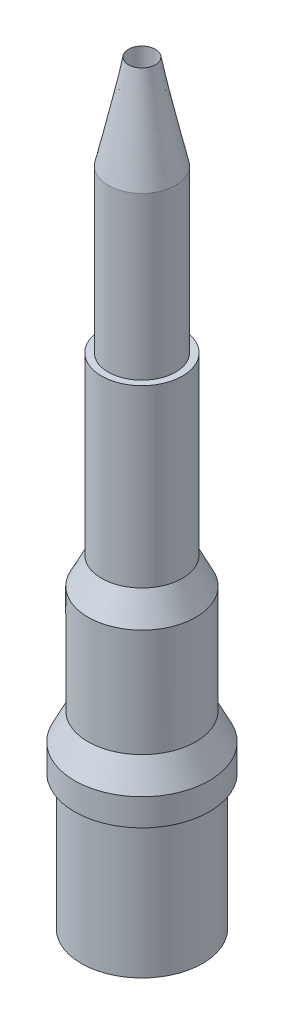
ISO-10303-21;
HEADER;
FILE_DESCRIPTION(('STEP AP214'),'2;1');
FILE_NAME('part.step','',(''),(''),'','','');
FILE_SCHEMA(('AUTOMOTIVE_DESIGN { 1 0 10303 214 1 1 1 1 }'));
ENDSEC;
DATA;
#1=APPLICATION_CONTEXT('core data for automotive mechanical design processes');
#2=APPLICATION_PROTOCOL_DEFINITION('international standard','automotive_design',2000,#1);
#3=PRODUCT_CONTEXT('',#1,'mechanical');
#4=PRODUCT('Part','Part','',(#3));
#5=PRODUCT_RELATED_PRODUCT_CATEGORY('part','',(#4));
#6=PRODUCT_DEFINITION_FORMATION('','',#4);
#7=PRODUCT_DEFINITION_CONTEXT('part definition',#1,'design');
#8=PRODUCT_DEFINITION('design','',#6,#7);
#9=PRODUCT_DEFINITION_SHAPE('','',#8);
#10=(LENGTH_UNIT() NAMED_UNIT(*) SI_UNIT(.MILLI.,.METRE.));
#11=(NAMED_UNIT(*) PLANE_ANGLE_UNIT() SI_UNIT($,.RADIAN.));
#12=(NAMED_UNIT(*) SI_UNIT($,.STERADIAN.) SOLID_ANGLE_UNIT());
#13=UNCERTAINTY_MEASURE_WITH_UNIT(LENGTH_MEASURE(1.E-05),#10,'distance_accuracy_value','');
#14=(GEOMETRIC_REPRESENTATION_CONTEXT(3) GLOBAL_UNCERTAINTY_ASSIGNED_CONTEXT((#13)) GLOBAL_UNIT_ASSIGNED_CONTEXT((#10,
#11,#12)) REPRESENTATION_CONTEXT('',''));
#15=CARTESIAN_POINT('',(0.,0.,0.));
#16=DIRECTION('',(0.,0.,1.));
#17=DIRECTION('',(1.,0.,0.));
#18=AXIS2_PLACEMENT_3D('',#15,#16,#17);
#19=CARTESIAN_POINT('',(0.,5.,0.));
#20=DIRECTION('',(0.,-1.,0.));
#21=DIRECTION('',(0.,0.,-1.));
#22=AXIS2_PLACEMENT_3D('',#19,#20,#21);
#23=CYLINDRICAL_SURFACE('',#22,2.25);
#24=CARTESIAN_POINT('',(0.,5.,0.));
#25=DIRECTION('',(0.,1.,0.));
#26=DIRECTION('',(0.,0.,1.));
#27=AXIS2_PLACEMENT_3D('',#24,#25,#26);
#28=CIRCLE('',#27,2.25);
#29=CARTESIAN_POINT('',(0.,5.,2.25));
#30=VERTEX_POINT('',#29);
#31=EDGE_CURVE('E50',#30,#30,#28,.T.);
#32=ORIENTED_EDGE('',*,*,#31,.F.);
#33=EDGE_LOOP('',(#32));
#34=FACE_BOUND('',#33,.T.);
#35=CARTESIAN_POINT('',(0.,0.,0.));
#36=DIRECTION('',(0.,1.,0.));
#37=DIRECTION('',(0.,0.,1.));
#38=AXIS2_PLACEMENT_3D('',#35,#36,#37);
#39=CIRCLE('',#38,2.25);
#40=CARTESIAN_POINT('',(0.,0.,2.25));
#41=VERTEX_POINT('',#40);
#42=EDGE_CURVE('E100',#41,#41,#39,.T.);
#43=ORIENTED_EDGE('',*,*,#42,.T.);
#44=EDGE_LOOP('',(#43));
#45=FACE_BOUND('',#44,.T.);
#46=ADVANCED_FACE('F36',(#34,#45),#23,.T.);
#47=CARTESIAN_POINT('',(0.,0.,0.));
#48=DIRECTION('',(0.,1.,0.));
#49=DIRECTION('',(0.,0.,1.));
#50=AXIS2_PLACEMENT_3D('',#47,#48,#49);
#51=PLANE('',#50);
#52=CARTESIAN_POINT('',(0.,0.,0.));
#53=DIRECTION('',(0.,1.,0.));
#54=DIRECTION('',(0.,0.,1.));
#55=AXIS2_PLACEMENT_3D('',#52,#53,#54);
#56=CIRCLE('',#55,0.5);
#57=CARTESIAN_POINT('',(0.,0.,0.5));
#58=VERTEX_POINT('',#57);
#59=EDGE_CURVE('E150',#58,#58,#56,.T.);
#60=ORIENTED_EDGE('',*,*,#59,.T.);
#61=EDGE_LOOP('',(#60));
#62=FACE_BOUND('',#61,.T.);
#63=ORIENTED_EDGE('',*,*,#42,.F.);
#64=EDGE_LOOP('',(#63));
#65=FACE_BOUND('',#64,.T.);
#66=ADVANCED_FACE('F106',(#62,#65),#51,.F.);
#67=CARTESIAN_POINT('',(0.,7.,0.));
#68=DIRECTION('',(0.,-1.,0.));
#69=DIRECTION('',(0.,0.,-1.));
#70=AXIS2_PLACEMENT_3D('',#67,#68,#69);
#71=CYLINDRICAL_SURFACE('',#70,2.5);
#72=CARTESIAN_POINT('',(0.,5.99999999999999,0.));
#73=DIRECTION('',(0.,1.,0.));
#74=DIRECTION('',(0.,0.,1.));
#75=AXIS2_PLACEMENT_3D('',#72,#73,#74);
#76=CIRCLE('',#75,2.5);
#77=CARTESIAN_POINT('',(0.,5.99999999999999,2.5));
#78=VERTEX_POINT('',#77);
#79=EDGE_CURVE('E11',#78,#78,#76,.F.);
#80=ORIENTED_EDGE('',*,*,#79,.T.);
#81=EDGE_LOOP('',(#80));
#82=FACE_BOUND('',#81,.T.);
#83=CARTESIAN_POINT('',(0.,5.,0.));
#84=DIRECTION('',(0.,1.,0.));
#85=DIRECTION('',(0.,0.,1.));
#86=AXIS2_PLACEMENT_3D('',#83,#84,#85);
#87=CIRCLE('',#86,2.5);
#88=CARTESIAN_POINT('',(0.,5.,2.5));
#89=VERTEX_POINT('',#88);
#90=EDGE_CURVE('E57',#89,#89,#87,.T.);
#91=ORIENTED_EDGE('',*,*,#90,.T.);
#92=EDGE_LOOP('',(#91));
#93=FACE_BOUND('',#92,.T.);
#94=ADVANCED_FACE('F108',(#82,#93),#71,.T.);
#95=CARTESIAN_POINT('',(0.,5.,0.));
#96=DIRECTION('',(0.,1.,0.));
#97=DIRECTION('',(0.,0.,1.));
#98=AXIS2_PLACEMENT_3D('',#95,#96,#97);
#99=PLANE('',#98);
#100=ORIENTED_EDGE('',*,*,#31,.T.);
#101=EDGE_LOOP('',(#100));
#102=FACE_BOUND('',#101,.T.);
#103=ORIENTED_EDGE('',*,*,#90,.F.);
#104=EDGE_LOOP('',(#103));
#105=FACE_BOUND('',#104,.T.);
#106=ADVANCED_FACE('F115',(#102,#105),#99,.F.);
#107=CARTESIAN_POINT('',(0.,7.,0.));
#108=DIRECTION('',(0.,-1.,0.));
#109=DIRECTION('',(0.,0.,-1.));
#110=AXIS2_PLACEMENT_3D('',#107,#108,#109);
#111=CONICAL_SURFACE('',#110,2.,0.463647609000804);
#112=ORIENTED_EDGE('',*,*,#79,.F.);
#113=EDGE_LOOP('',(#112));
#114=FACE_BOUND('',#113,.T.);
#115=CARTESIAN_POINT('',(0.,7.,0.));
#116=DIRECTION('',(0.,1.,0.));
#117=DIRECTION('',(0.,0.,1.));
#118=AXIS2_PLACEMENT_3D('',#115,#116,#117);
#119=CIRCLE('',#118,2.);
#120=CARTESIAN_POINT('',(0.,7.,2.));
#121=VERTEX_POINT('',#120);
#122=EDGE_CURVE('E45',#121,#121,#119,.T.);
#123=ORIENTED_EDGE('',*,*,#122,.F.);
#124=EDGE_LOOP('',(#123));
#125=FACE_BOUND('',#124,.T.);
#126=ADVANCED_FACE('F38',(#114,#125),#111,.T.);
#127=CARTESIAN_POINT('',(0.,11.,0.));
#128=DIRECTION('',(0.,-1.,0.));
#129=DIRECTION('',(0.,0.,-1.));
#130=AXIS2_PLACEMENT_3D('',#127,#128,#129);
#131=CYLINDRICAL_SURFACE('',#130,2.);
#132=CARTESIAN_POINT('',(0.,11.,0.));
#133=DIRECTION('',(0.,-1.,0.));
#134=DIRECTION('',(0.,0.,-1.));
#135=AXIS2_PLACEMENT_3D('',#132,#133,#134);
#136=CIRCLE('',#135,2.);
#137=CARTESIAN_POINT('',(0.,11.,-2.));
#138=VERTEX_POINT('',#137);
#139=EDGE_CURVE('E54',#138,#138,#136,.F.);
#140=ORIENTED_EDGE('',*,*,#139,.F.);
#141=EDGE_LOOP('',(#140));
#142=FACE_BOUND('',#141,.T.);
#143=ORIENTED_EDGE('',*,*,#122,.T.);
#144=EDGE_LOOP('',(#143));
#145=FACE_BOUND('',#144,.T.);
#146=ADVANCED_FACE('F83',(#142,#145),#131,.T.);
#147=CARTESIAN_POINT('',(0.,12.,0.));
#148=DIRECTION('',(0.,-1.,0.));
#149=DIRECTION('',(0.,0.,-1.));
#150=AXIS2_PLACEMENT_3D('',#147,#148,#149);
#151=CONICAL_SURFACE('',#150,1.5,0.463647609000806);
#152=ORIENTED_EDGE('',*,*,#139,.T.);
#153=EDGE_LOOP('',(#152));
#154=FACE_BOUND('',#153,.T.);
#155=CARTESIAN_POINT('',(0.,12.,0.));
#156=DIRECTION('',(0.,1.,0.));
#157=DIRECTION('',(0.,0.,1.));
#158=AXIS2_PLACEMENT_3D('',#155,#156,#157);
#159=CIRCLE('',#158,1.5);
#160=CARTESIAN_POINT('',(0.,12.,-1.5));
#161=VERTEX_POINT('',#160);
#162=EDGE_CURVE('E40',#161,#161,#159,.T.);
#163=ORIENTED_EDGE('',*,*,#162,.F.);
#164=EDGE_LOOP('',(#163));
#165=FACE_BOUND('',#164,.T.);
#166=ADVANCED_FACE('F77',(#154,#165),#151,.T.);
#167=CARTESIAN_POINT('',(0.,18.5,0.));
#168=DIRECTION('',(0.,-1.,0.));
#169=DIRECTION('',(0.,0.,-1.));
#170=AXIS2_PLACEMENT_3D('',#167,#168,#169);
#171=CYLINDRICAL_SURFACE('',#170,1.5);
#172=CARTESIAN_POINT('',(0.,18.5,0.));
#173=DIRECTION('',(0.,1.,0.));
#174=DIRECTION('',(0.,0.,1.));
#175=AXIS2_PLACEMENT_3D('',#172,#173,#174);
#176=CIRCLE('',#175,1.5);
#177=CARTESIAN_POINT('',(0.,18.5,-1.5));
#178=VERTEX_POINT('',#177);
#179=EDGE_CURVE('E140',#178,#178,#176,.T.);
#180=CARTESIAN_POINT('',(0.,18.5,-1.5));
#181=CARTESIAN_POINT('',(0.,18.4322916666667,-1.5));
#182=CARTESIAN_POINT('',(0.,18.3645833333333,-1.5));
#183=CARTESIAN_POINT('',(0.,18.2291666666667,-1.5));
#184=CARTESIAN_POINT('',(0.,18.1614583333333,-1.5));
#185=CARTESIAN_POINT('',(0.,18.0260416666667,-1.5));
#186=CARTESIAN_POINT('',(0.,17.9583333333333,-1.5));
#187=CARTESIAN_POINT('',(0.,17.8229166666667,-1.5));
#188=CARTESIAN_POINT('',(0.,17.7552083333333,-1.5));
#189=CARTESIAN_POINT('',(0.,17.6197916666667,-1.5));
#190=CARTESIAN_POINT('',(0.,17.5520833333333,-1.5));
#191=CARTESIAN_POINT('',(0.,17.4166666666667,-1.5));
#192=CARTESIAN_POINT('',(0.,17.3489583333333,-1.5));
#193=CARTESIAN_POINT('',(0.,17.2135416666667,-1.5));
#194=CARTESIAN_POINT('',(0.,17.1458333333333,-1.5));
#195=CARTESIAN_POINT('',(0.,17.0104166666667,-1.5));
#196=CARTESIAN_POINT('',(0.,16.9427083333333,-1.5));
#197=CARTESIAN_POINT('',(0.,16.8072916666667,-1.5));
#198=CARTESIAN_POINT('',(0.,16.7395833333333,-1.5));
#199=CARTESIAN_POINT('',(0.,16.6041666666667,-1.5));
#200=CARTESIAN_POINT('',(0.,16.5364583333333,-1.5));
#201=CARTESIAN_POINT('',(0.,16.4010416666667,-1.5));
#202=CARTESIAN_POINT('',(0.,16.3333333333333,-1.5));
#203=CARTESIAN_POINT('',(0.,16.1979166666667,-1.5));
#204=CARTESIAN_POINT('',(0.,16.1302083333333,-1.5));
#205=CARTESIAN_POINT('',(0.,15.9947916666667,-1.5));
#206=CARTESIAN_POINT('',(0.,15.9270833333333,-1.5));
#207=CARTESIAN_POINT('',(0.,15.7916666666667,-1.5));
#208=CARTESIAN_POINT('',(0.,15.7239583333333,-1.5));
#209=CARTESIAN_POINT('',(0.,15.5885416666667,-1.5));
#210=CARTESIAN_POINT('',(0.,15.5208333333333,-1.5));
#211=CARTESIAN_POINT('',(0.,15.3854166666667,-1.5));
#212=CARTESIAN_POINT('',(0.,15.3177083333333,-1.5));
#213=CARTESIAN_POINT('',(0.,15.1822916666667,-1.5));
#214=CARTESIAN_POINT('',(0.,15.1145833333333,-1.5));
#215=CARTESIAN_POINT('',(0.,14.9791666666667,-1.5));
#216=CARTESIAN_POINT('',(0.,14.9114583333333,-1.5));
#217=CARTESIAN_POINT('',(0.,14.7760416666667,-1.5));
#218=CARTESIAN_POINT('',(0.,14.7083333333333,-1.5));
#219=CARTESIAN_POINT('',(0.,14.5729166666667,-1.5));
#220=CARTESIAN_POINT('',(0.,14.5052083333333,-1.5));
#221=CARTESIAN_POINT('',(0.,14.3697916666667,-1.5));
#222=CARTESIAN_POINT('',(0.,14.3020833333333,-1.5));
#223=CARTESIAN_POINT('',(0.,14.1666666666667,-1.5));
#224=CARTESIAN_POINT('',(0.,14.0989583333333,-1.5));
#225=CARTESIAN_POINT('',(0.,13.9635416666667,-1.5));
#226=CARTESIAN_POINT('',(0.,13.8958333333333,-1.5));
#227=CARTESIAN_POINT('',(0.,13.7604166666667,-1.5));
#228=CARTESIAN_POINT('',(0.,13.6927083333333,-1.5));
#229=CARTESIAN_POINT('',(0.,13.5572916666667,-1.5));
#230=CARTESIAN_POINT('',(0.,13.4895833333333,-1.5));
#231=CARTESIAN_POINT('',(0.,13.3541666666667,-1.5));
#232=CARTESIAN_POINT('',(0.,13.2864583333333,-1.5));
#233=CARTESIAN_POINT('',(0.,13.1510416666667,-1.5));
#234=CARTESIAN_POINT('',(0.,13.0833333333333,-1.5));
#235=CARTESIAN_POINT('',(0.,12.9479166666667,-1.5));
#236=CARTESIAN_POINT('',(0.,12.8802083333333,-1.5));
#237=CARTESIAN_POINT('',(0.,12.7447916666667,-1.5));
#238=CARTESIAN_POINT('',(0.,12.6770833333333,-1.5));
#239=CARTESIAN_POINT('',(0.,12.5416666666667,-1.5));
#240=CARTESIAN_POINT('',(0.,12.4739583333333,-1.5));
#241=CARTESIAN_POINT('',(0.,12.3385416666667,-1.5));
#242=CARTESIAN_POINT('',(0.,12.2708333333333,-1.5));
#243=CARTESIAN_POINT('',(0.,12.1354166666667,-1.5));
#244=CARTESIAN_POINT('',(0.,12.0677083333333,-1.5));
#245=CARTESIAN_POINT('',(0.,12.,-1.5));
#246=B_SPLINE_CURVE_WITH_KNOTS('',3,(#180,#181,#182,#183,#184,#185,#186,#187,#188,#189,#190,
#191,#192,#193,#194,#195,#196,#197,#198,#199,#200,#201,#202,#203,#204,#205,#206,#207,#208,#209,
#210,#211,#212,#213,#214,#215,#216,#217,#218,#219,#220,#221,#222,#223,#224,#225,#226,#227,#228,
#229,#230,#231,#232,#233,#234,#235,#236,#237,#238,#239,#240,#241,#242,#243,#244,#245),
.UNSPECIFIED.,.F.,.F.,(4,2,2,2,2,2,2,2,2,2,2,2,2,2,2,2,2,2,2,2,2,2,2,2,2,2,2,2,2,2,2,2,4),(0.,
0.203125000000002,0.40625,0.609375000000002,0.812500000000001,1.015625,1.21875,1.421875,1.625,
1.828125,2.03125,2.234375,2.4375,2.640625,2.84375,3.046875,3.25,3.453125,3.65625,3.859375,
4.0625,4.265625,4.46875,4.671875,4.875,5.078125,5.28125,5.484375,5.6875,5.890625,6.09375,
6.296875,6.5),.UNSPECIFIED.);
#247=EDGE_CURVE('BSEAM66',#178,#161,#246,.T.);
#248=ORIENTED_EDGE('',*,*,#179,.F.);
#249=ORIENTED_EDGE('',*,*,#162,.T.);
#250=ORIENTED_EDGE('',*,*,#247,.T.);
#251=ORIENTED_EDGE('',*,*,#247,.F.);
#252=EDGE_LOOP('',(#248,#250,#249,#251));
#253=FACE_BOUND('',#252,.T.);
#254=ADVANCED_FACE('F66',(#253),#171,.T.);
#255=CARTESIAN_POINT('',(0.,18.5,0.));
#256=DIRECTION('',(0.,1.,0.));
#257=DIRECTION('',(0.,0.,1.));
#258=AXIS2_PLACEMENT_3D('',#255,#256,#257);
#259=PLANE('',#258);
#260=CARTESIAN_POINT('',(0.,18.5,0.));
#261=DIRECTION('',(0.,1.,0.));
#262=DIRECTION('',(0.,0.,1.));
#263=AXIS2_PLACEMENT_3D('',#260,#261,#262);
#264=CIRCLE('',#263,1.25);
#265=CARTESIAN_POINT('',(0.,18.5,1.25));
#266=VERTEX_POINT('',#265);
#267=EDGE_CURVE('E146',#266,#266,#264,.T.);
#268=ORIENTED_EDGE('',*,*,#267,.F.);
#269=EDGE_LOOP('',(#268));
#270=FACE_BOUND('',#269,.T.);
#271=ORIENTED_EDGE('',*,*,#179,.T.);
#272=EDGE_LOOP('',(#271));
#273=FACE_BOUND('',#272,.T.);
#274=ADVANCED_FACE('F76',(#270,#273),#259,.T.);
#275=CARTESIAN_POINT('',(0.,24.5,0.));
#276=DIRECTION('',(0.,-1.,0.));
#277=DIRECTION('',(0.,0.,-1.));
#278=AXIS2_PLACEMENT_3D('',#275,#276,#277);
#279=CYLINDRICAL_SURFACE('',#278,1.25);
#280=CARTESIAN_POINT('',(0.,24.5,0.));
#281=DIRECTION('',(0.,1.,0.));
#282=DIRECTION('',(0.,0.,1.));
#283=AXIS2_PLACEMENT_3D('',#280,#281,#282);
#284=CIRCLE('',#283,1.25);
#285=CARTESIAN_POINT('',(0.351754629549075,24.5,-1.19948684052423));
#286=VERTEX_POINT('',#285);
#287=EDGE_CURVE('E142',#286,#286,#284,.T.);
#288=ORIENTED_EDGE('',*,*,#287,.F.);
#289=EDGE_LOOP('',(#288));
#290=FACE_BOUND('',#289,.T.);
#291=ORIENTED_EDGE('',*,*,#267,.T.);
#292=EDGE_LOOP('',(#291));
#293=FACE_BOUND('',#292,.T.);
#294=ADVANCED_FACE('F165',(#290,#293),#279,.T.);
#295=CARTESIAN_POINT('',(0.351754629549075,24.5,-1.19948684052423));
#296=CARTESIAN_POINT('',(0.334643117785164,28.,-0.371502333396474));
#297=CARTESIAN_POINT('',(-2.04721905149938,24.5,-1.90299609962238));
#298=CARTESIAN_POINT('',(-0.408361549007783,28.,-1.0407885689668));
#299=CARTESIAN_POINT('',(-2.75072831059753,24.5,0.495977581426074));
#300=CARTESIAN_POINT('',(-1.07764778457811,28.,-0.297783902173855));
#301=CARTESIAN_POINT('',(-0.351754629549077,24.5,1.19948684052423));
#302=CARTESIAN_POINT('',(-0.334643117785164,28.,0.371502333396474));
#303=CARTESIAN_POINT('',(2.04721905149938,24.5,1.90299609962238));
#304=CARTESIAN_POINT('',(0.408361549007783,28.,1.0407885689668));
#305=CARTESIAN_POINT('',(2.75072831059753,24.5,-0.495977581426074));
#306=CARTESIAN_POINT('',(1.07764778457811,28.,0.297783902173854));
#307=CARTESIAN_POINT('',(0.351754629549075,24.5,-1.19948684052423));
#308=CARTESIAN_POINT('',(0.334643117785164,28.,-0.371502333396474));
#309=(BOUNDED_SURFACE() B_SPLINE_SURFACE(3,1,((#295,#296),(#297,#298),(#299,#300),(#301,#302),
(#303,#304),(#305,#306),(#307,#308)),.UNSPECIFIED.,.T.,.F.,.F.) B_SPLINE_SURFACE_WITH_KNOTS((4,
3,4),(2,2),(0.,0.5,1.),(0.,1.),
.UNSPECIFIED.) GEOMETRIC_REPRESENTATION_ITEM() RATIONAL_B_SPLINE_SURFACE(((1.,1.),
(0.333333333333334,0.333333333333333),(0.333333333333334,0.333333333333333),(1.,1.),
(0.333333333333333,0.333333333333333),(0.333333333333333,0.333333333333333),(1.,1.))) REPRESENTATION_ITEM('') SURFACE());
#310=CARTESIAN_POINT('',(0.,28.,0.));
#311=DIRECTION('',(0.,1.,0.));
#312=DIRECTION('',(0.,0.,1.));
#313=AXIS2_PLACEMENT_3D('',#310,#311,#312);
#314=CIRCLE('',#313,0.5);
#315=CARTESIAN_POINT('',(0.334643117785164,28.,-0.371502333396474));
#316=VERTEX_POINT('',#315);
#317=EDGE_CURVE('E152',#316,#316,#314,.T.);
#318=CARTESIAN_POINT('',(0.351754629549075,24.5,-1.19948684052423));
#319=CARTESIAN_POINT('',(0.351576384634868,24.5364583333333,-1.19086200190831));
#320=CARTESIAN_POINT('',(0.351398139720661,24.5729166666667,-1.1822371632924));
#321=CARTESIAN_POINT('',(0.351041649892246,24.6458333333333,-1.16498748606057));
#322=CARTESIAN_POINT('',(0.350863404978038,24.6822916666667,-1.15636264744466));
#323=CARTESIAN_POINT('',(0.350506915149624,24.7552083333333,-1.13911297021283));
#324=CARTESIAN_POINT('',(0.350328670235416,24.7916666666667,-1.13048813159691));
#325=CARTESIAN_POINT('',(0.349972180407001,24.8645833333333,-1.11323845436509));
#326=CARTESIAN_POINT('',(0.349793935492794,24.9010416666667,-1.10461361574917));
#327=CARTESIAN_POINT('',(0.349437445664379,24.9739583333333,-1.08736393851734));
#328=CARTESIAN_POINT('',(0.349259200750172,25.0104166666667,-1.07873909990143));
#329=CARTESIAN_POINT('',(0.348902710921757,25.0833333333333,-1.0614894226696));
#330=CARTESIAN_POINT('',(0.348724466007549,25.1197916666667,-1.05286458405369));
#331=CARTESIAN_POINT('',(0.348367976179135,25.1927083333333,-1.03561490682186));
#332=CARTESIAN_POINT('',(0.348189731264927,25.2291666666667,-1.02699006820595));
#333=CARTESIAN_POINT('',(0.347833241436512,25.3020833333333,-1.00974039097412));
#334=CARTESIAN_POINT('',(0.347654996522305,25.3385416666667,-1.0011155523582));
#335=CARTESIAN_POINT('',(0.34729850669389,25.4114583333333,-0.983865875126375));
#336=CARTESIAN_POINT('',(0.347120261779683,25.4479166666667,-0.975241036510461));
#337=CARTESIAN_POINT('',(0.346763771951268,25.5208333333333,-0.957991359278632));
#338=CARTESIAN_POINT('',(0.346585527037061,25.5572916666667,-0.949366520662718));
#339=CARTESIAN_POINT('',(0.346229037208646,25.6302083333333,-0.93211684343089));
#340=CARTESIAN_POINT('',(0.346050792294438,25.6666666666667,-0.923492004814976));
#341=CARTESIAN_POINT('',(0.345694302466024,25.7395833333333,-0.906242327583148));
#342=CARTESIAN_POINT('',(0.345516057551816,25.7760416666667,-0.897617488967234));
#343=CARTESIAN_POINT('',(0.345159567723401,25.8489583333333,-0.880367811735406));
#344=CARTESIAN_POINT('',(0.344981322809194,25.8854166666667,-0.871742973119492));
#345=CARTESIAN_POINT('',(0.344624832980779,25.9583333333333,-0.854493295887663));
#346=CARTESIAN_POINT('',(0.344446588066572,25.9947916666667,-0.845868457271749));
#347=CARTESIAN_POINT('',(0.344090098238157,26.0677083333333,-0.828618780039921));
#348=CARTESIAN_POINT('',(0.343911853323949,26.1041666666667,-0.819993941424007));
#349=CARTESIAN_POINT('',(0.343555363495535,26.1770833333333,-0.802744264192179));
#350=CARTESIAN_POINT('',(0.343377118581327,26.2135416666667,-0.794119425576265));
#351=CARTESIAN_POINT('',(0.343020628752912,26.2864583333333,-0.776869748344436));
#352=CARTESIAN_POINT('',(0.342842383838705,26.3229166666667,-0.768244909728522));
#353=CARTESIAN_POINT('',(0.34248589401029,26.3958333333333,-0.750995232496694));
#354=CARTESIAN_POINT('',(0.342307649096083,26.4322916666667,-0.74237039388078));
#355=CARTESIAN_POINT('',(0.341951159267668,26.5052083333333,-0.725120716648952));
#356=CARTESIAN_POINT('',(0.341772914353461,26.5416666666667,-0.716495878033037));
#357=CARTESIAN_POINT('',(0.341416424525046,26.6145833333333,-0.69924620080121));
#358=CARTESIAN_POINT('',(0.341238179610838,26.6510416666667,-0.690621362185296));
#359=CARTESIAN_POINT('',(0.340881689782424,26.7239583333333,-0.673371684953467));
#360=CARTESIAN_POINT('',(0.340703444868216,26.7604166666667,-0.664746846337553));
#361=CARTESIAN_POINT('',(0.340346955039801,26.8333333333333,-0.647497169105725));
#362=CARTESIAN_POINT('',(0.340168710125594,26.8697916666667,-0.638872330489811));
#363=CARTESIAN_POINT('',(0.339812220297179,26.9427083333333,-0.621622653257983));
#364=CARTESIAN_POINT('',(0.339633975382972,26.9791666666667,-0.612997814642068));
#365=CARTESIAN_POINT('',(0.339277485554557,27.0520833333333,-0.59574813741024));
#366=CARTESIAN_POINT('',(0.339099240640349,27.0885416666667,-0.587123298794326));
#367=CARTESIAN_POINT('',(0.338742750811935,27.1614583333333,-0.569873621562498));
#368=CARTESIAN_POINT('',(0.338564505897727,27.1979166666667,-0.561248782946584));
#369=CARTESIAN_POINT('',(0.338208016069312,27.2708333333333,-0.543999105714756));
#370=CARTESIAN_POINT('',(0.338029771155105,27.3072916666667,-0.535374267098841));
#371=CARTESIAN_POINT('',(0.33767328132669,27.3802083333333,-0.518124589867013));
#372=CARTESIAN_POINT('',(0.337495036412483,27.4166666666667,-0.509499751251099));
#373=CARTESIAN_POINT('',(0.337138546584068,27.4895833333333,-0.492250074019271));
#374=CARTESIAN_POINT('',(0.336960301669861,27.5260416666667,-0.483625235403357));
#375=CARTESIAN_POINT('',(0.336603811841446,27.5989583333333,-0.466375558171529));
#376=CARTESIAN_POINT('',(0.336425566927238,27.6354166666667,-0.457750719555615));
#377=CARTESIAN_POINT('',(0.336069077098824,27.7083333333333,-0.440501042323787));
#378=CARTESIAN_POINT('',(0.335890832184616,27.7447916666667,-0.431876203707872));
#379=CARTESIAN_POINT('',(0.335534342356201,27.8177083333333,-0.414626526476044));
#380=CARTESIAN_POINT('',(0.335356097441994,27.8541666666667,-0.40600168786013));
#381=CARTESIAN_POINT('',(0.334999607613579,27.9270833333333,-0.388752010628302));
#382=CARTESIAN_POINT('',(0.334821362699372,27.9635416666667,-0.380127172012388));
#383=CARTESIAN_POINT('',(0.334643117785164,28.,-0.371502333396474));
#384=B_SPLINE_CURVE_WITH_KNOTS('',3,(#318,#319,#320,#321,#322,#323,#324,#325,#326,#327,#328,
#329,#330,#331,#332,#333,#334,#335,#336,#337,#338,#339,#340,#341,#342,#343,#344,#345,#346,#347,
#348,#349,#350,#351,#352,#353,#354,#355,#356,#357,#358,#359,#360,#361,#362,#363,#364,#365,#366,
#367,#368,#369,#370,#371,#372,#373,#374,#375,#376,#377,#378,#379,#380,#381,#382,#383),
.UNSPECIFIED.,.F.,.F.,(4,2,2,2,2,2,2,2,2,2,2,2,2,2,2,2,2,2,2,2,2,2,2,2,2,2,2,2,2,2,2,2,4),(0.,
0.112395138402871,0.224790276805738,0.337185415208605,0.449580553611476,0.561975692014343,
0.674370830417213,0.786765968820081,0.899161107222951,1.01155624562582,1.12395138402869,
1.23634652243156,1.34874166083443,1.46113679923729,1.57353193764016,1.68592707604303,
1.7983222144459,1.91071735284877,2.02311249125164,2.13550762965451,2.24790276805738,
2.36029790646024,2.47269304486311,2.58508818326598,2.69748332166885,2.80987846007172,
2.92227359847459,3.03466873687746,3.14706387528033,3.2594590136832,3.37185415208606,
3.48424929048893,3.5966444288918),.UNSPECIFIED.);
#385=EDGE_CURVE('BSEAM160',#286,#316,#384,.T.);
#386=ORIENTED_EDGE('',*,*,#287,.T.);
#387=ORIENTED_EDGE('',*,*,#317,.F.);
#388=ORIENTED_EDGE('',*,*,#385,.T.);
#389=ORIENTED_EDGE('',*,*,#385,.F.);
#390=EDGE_LOOP('',(#386,#388,#387,#389));
#391=FACE_BOUND('',#390,.T.);
#392=ADVANCED_FACE('F160',(#391),#309,.T.);
#393=CARTESIAN_POINT('',(0.,0.,0.));
#394=DIRECTION('',(0.,1.,0.));
#395=DIRECTION('',(0.,0.,1.));
#396=AXIS2_PLACEMENT_3D('',#393,#394,#395);
#397=CYLINDRICAL_SURFACE('',#396,0.5);
#398=ORIENTED_EDGE('',*,*,#59,.F.);
#399=EDGE_LOOP('',(#398));
#400=FACE_BOUND('',#399,.T.);
#401=ORIENTED_EDGE('',*,*,#317,.T.);
#402=EDGE_LOOP('',(#401));
#403=FACE_BOUND('',#402,.T.);
#404=ADVANCED_FACE('F157',(#400,#403),#397,.F.);
#405=CLOSED_SHELL('',(#46,#66,#94,#106,#126,#146,#166,#254,#274,#294,#392,#404));
#406=MANIFOLD_SOLID_BREP('B2',#405);
#407=ADVANCED_BREP_SHAPE_REPRESENTATION('',(#18,#406),#14);
#408=SHAPE_DEFINITION_REPRESENTATION(#9,#407);
ENDSEC;
END-ISO-10303-21;
